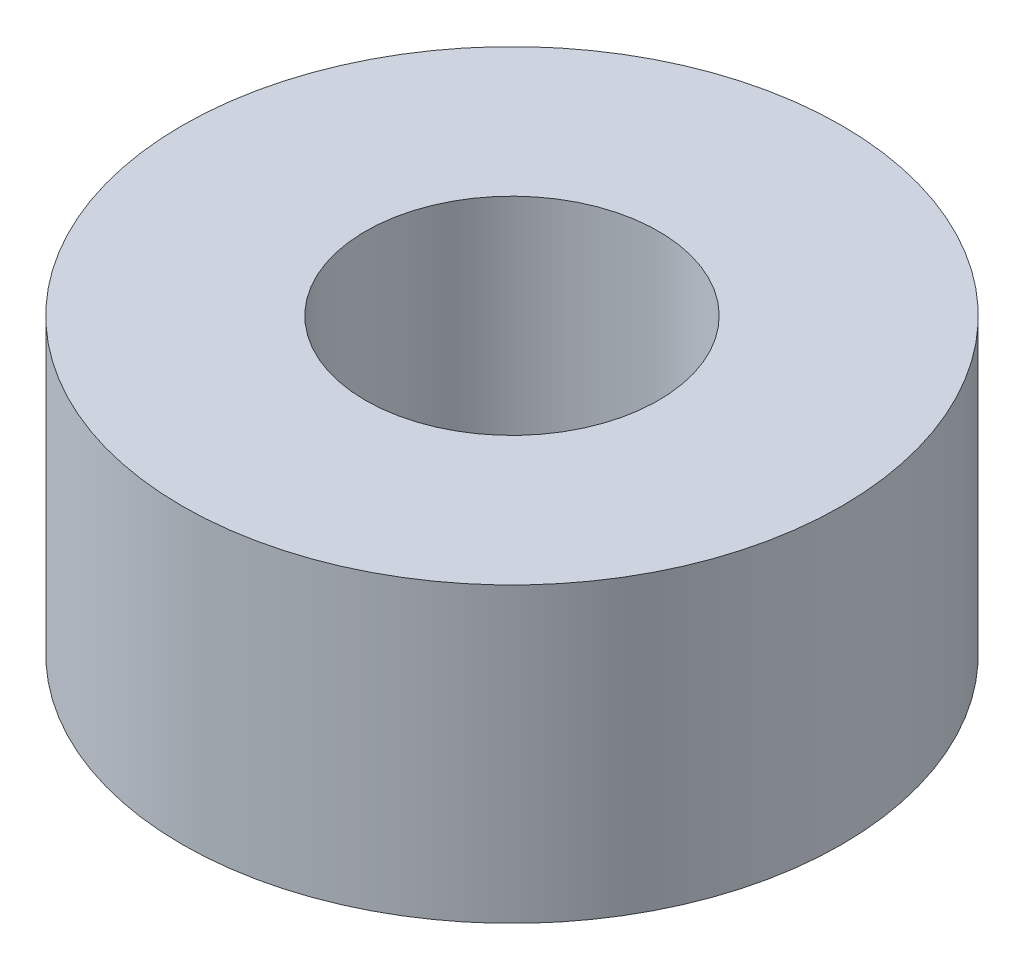
ISO-10303-21;
HEADER;
FILE_DESCRIPTION(('STEP AP214'),'2;1');
FILE_NAME('part.step','',(''),(''),'','','');
FILE_SCHEMA(('AUTOMOTIVE_DESIGN { 1 0 10303 214 1 1 1 1 }'));
ENDSEC;
DATA;
#1=APPLICATION_CONTEXT('core data for automotive mechanical design processes');
#2=APPLICATION_PROTOCOL_DEFINITION('international standard','automotive_design',2000,#1);
#3=PRODUCT_CONTEXT('',#1,'mechanical');
#4=PRODUCT('Part','Part','',(#3));
#5=PRODUCT_RELATED_PRODUCT_CATEGORY('part','',(#4));
#6=PRODUCT_DEFINITION_FORMATION('','',#4);
#7=PRODUCT_DEFINITION_CONTEXT('part definition',#1,'design');
#8=PRODUCT_DEFINITION('design','',#6,#7);
#9=PRODUCT_DEFINITION_SHAPE('','',#8);
#10=(LENGTH_UNIT() NAMED_UNIT(*) SI_UNIT(.MILLI.,.METRE.));
#11=(NAMED_UNIT(*) PLANE_ANGLE_UNIT() SI_UNIT($,.RADIAN.));
#12=(NAMED_UNIT(*) SI_UNIT($,.STERADIAN.) SOLID_ANGLE_UNIT());
#13=UNCERTAINTY_MEASURE_WITH_UNIT(LENGTH_MEASURE(1.E-05),#10,'distance_accuracy_value','');
#14=(GEOMETRIC_REPRESENTATION_CONTEXT(3) GLOBAL_UNCERTAINTY_ASSIGNED_CONTEXT((#13)) GLOBAL_UNIT_ASSIGNED_CONTEXT((#10,
#11,#12)) REPRESENTATION_CONTEXT('',''));
#15=CARTESIAN_POINT('',(0.,0.,0.));
#16=DIRECTION('',(0.,0.,1.));
#17=DIRECTION('',(1.,0.,0.));
#18=AXIS2_PLACEMENT_3D('',#15,#16,#17);
#19=CARTESIAN_POINT('',(0.,4.,0.));
#20=DIRECTION('',(0.,1.,0.));
#21=DIRECTION('',(0.,0.,1.));
#22=AXIS2_PLACEMENT_3D('',#19,#20,#21);
#23=PLANE('',#22);
#24=CARTESIAN_POINT('',(0.,4.,0.));
#25=DIRECTION('',(0.,1.,0.));
#26=DIRECTION('',(0.,0.,1.));
#27=AXIS2_PLACEMENT_3D('',#24,#25,#26);
#28=CIRCLE('',#27,4.5);
#29=CARTESIAN_POINT('',(0.,4.,4.5));
#30=VERTEX_POINT('',#29);
#31=EDGE_CURVE('E10',#30,#30,#28,.T.);
#32=ORIENTED_EDGE('',*,*,#31,.T.);
#33=EDGE_LOOP('',(#32));
#34=FACE_BOUND('',#33,.T.);
#35=CARTESIAN_POINT('',(0.,4.,0.));
#36=DIRECTION('',(0.,1.,0.));
#37=DIRECTION('',(0.,0.,1.));
#38=AXIS2_PLACEMENT_3D('',#35,#36,#37);
#39=CIRCLE('',#38,2.);
#40=CARTESIAN_POINT('',(0.,4.,2.));
#41=VERTEX_POINT('',#40);
#42=EDGE_CURVE('E45',#41,#41,#39,.T.);
#43=ORIENTED_EDGE('',*,*,#42,.F.);
#44=EDGE_LOOP('',(#43));
#45=FACE_BOUND('',#44,.T.);
#46=ADVANCED_FACE('F34',(#34,#45),#23,.T.);
#47=CARTESIAN_POINT('',(0.,0.,0.));
#48=DIRECTION('',(0.,1.,0.));
#49=DIRECTION('',(0.,0.,1.));
#50=AXIS2_PLACEMENT_3D('',#47,#48,#49);
#51=PLANE('',#50);
#52=CARTESIAN_POINT('',(0.,0.,0.));
#53=DIRECTION('',(0.,1.,0.));
#54=DIRECTION('',(0.,0.,1.));
#55=AXIS2_PLACEMENT_3D('',#52,#53,#54);
#56=CIRCLE('',#55,4.5);
#57=CARTESIAN_POINT('',(0.,0.,4.5));
#58=VERTEX_POINT('',#57);
#59=EDGE_CURVE('E38',#58,#58,#56,.T.);
#60=ORIENTED_EDGE('',*,*,#59,.F.);
#61=EDGE_LOOP('',(#60));
#62=FACE_BOUND('',#61,.T.);
#63=CARTESIAN_POINT('',(0.,0.,0.));
#64=DIRECTION('',(0.,1.,0.));
#65=DIRECTION('',(0.,0.,1.));
#66=AXIS2_PLACEMENT_3D('',#63,#64,#65);
#67=CIRCLE('',#66,2.);
#68=CARTESIAN_POINT('',(0.,0.,2.));
#69=VERTEX_POINT('',#68);
#70=EDGE_CURVE('E47',#69,#69,#67,.T.);
#71=ORIENTED_EDGE('',*,*,#70,.T.);
#72=EDGE_LOOP('',(#71));
#73=FACE_BOUND('',#72,.T.);
#74=ADVANCED_FACE('F57',(#62,#73),#51,.F.);
#75=CARTESIAN_POINT('',(0.,4.,0.));
#76=DIRECTION('',(0.,-1.,0.));
#77=DIRECTION('',(0.,0.,-1.));
#78=AXIS2_PLACEMENT_3D('',#75,#76,#77);
#79=CYLINDRICAL_SURFACE('',#78,4.5);
#80=ORIENTED_EDGE('',*,*,#31,.F.);
#81=EDGE_LOOP('',(#80));
#82=FACE_BOUND('',#81,.T.);
#83=ORIENTED_EDGE('',*,*,#59,.T.);
#84=EDGE_LOOP('',(#83));
#85=FACE_BOUND('',#84,.T.);
#86=ADVANCED_FACE('F36',(#82,#85),#79,.T.);
#87=CARTESIAN_POINT('',(0.,4.,0.));
#88=DIRECTION('',(0.,-1.,0.));
#89=DIRECTION('',(0.,0.,-1.));
#90=AXIS2_PLACEMENT_3D('',#87,#88,#89);
#91=CYLINDRICAL_SURFACE('',#90,2.);
#92=ORIENTED_EDGE('',*,*,#42,.T.);
#93=EDGE_LOOP('',(#92));
#94=FACE_BOUND('',#93,.T.);
#95=ORIENTED_EDGE('',*,*,#70,.F.);
#96=EDGE_LOOP('',(#95));
#97=FACE_BOUND('',#96,.T.);
#98=ADVANCED_FACE('F53',(#94,#97),#91,.F.);
#99=CLOSED_SHELL('',(#46,#74,#86,#98));
#100=MANIFOLD_SOLID_BREP('B2',#99);
#101=ADVANCED_BREP_SHAPE_REPRESENTATION('',(#18,#100),#14);
#102=SHAPE_DEFINITION_REPRESENTATION(#9,#101);
ENDSEC;
END-ISO-10303-21;
